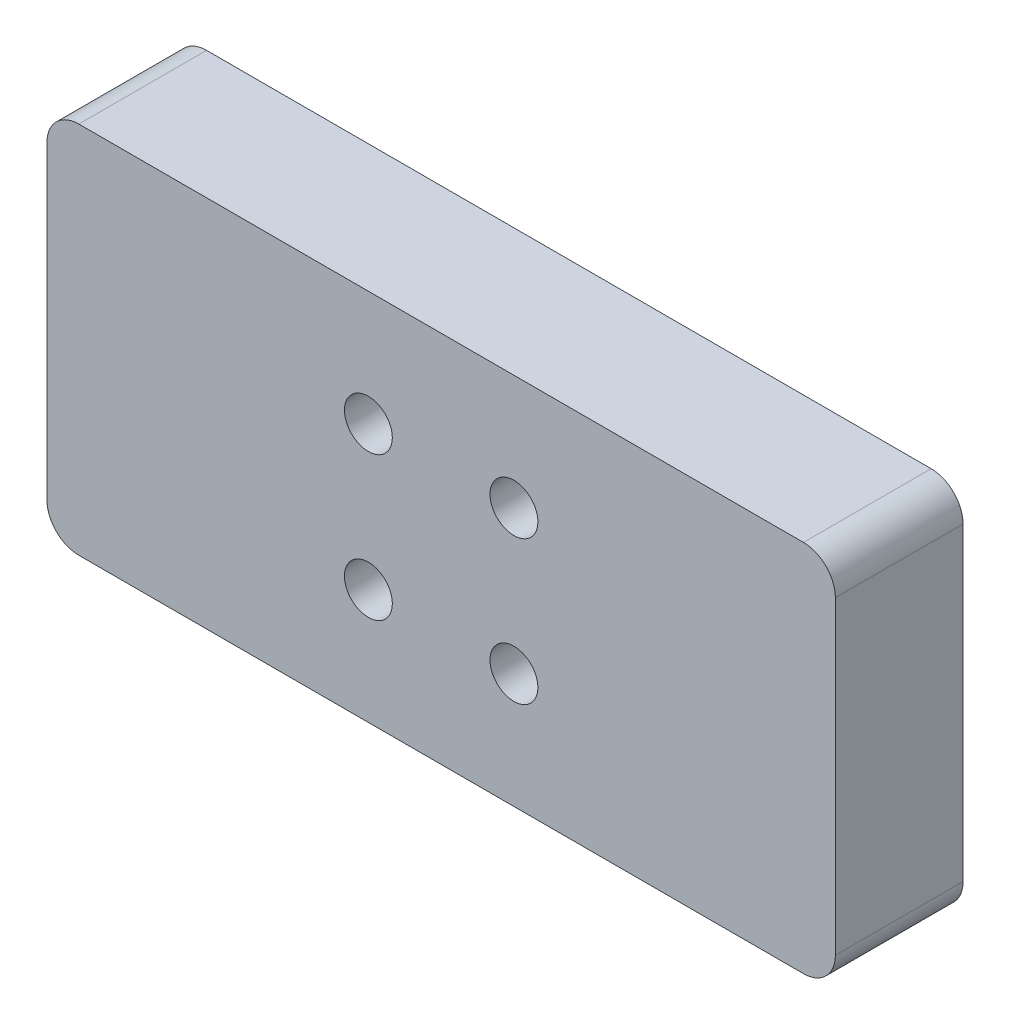
ISO-10303-21;
HEADER;
FILE_DESCRIPTION(('STEP AP214'),'2;1');
FILE_NAME('part.step','',(''),(''),'','','');
FILE_SCHEMA(('AUTOMOTIVE_DESIGN { 1 0 10303 214 1 1 1 1 }'));
ENDSEC;
DATA;
#1=APPLICATION_CONTEXT('core data for automotive mechanical design processes');
#2=APPLICATION_PROTOCOL_DEFINITION('international standard','automotive_design',2000,#1);
#3=PRODUCT_CONTEXT('',#1,'mechanical');
#4=PRODUCT('Part','Part','',(#3));
#5=PRODUCT_RELATED_PRODUCT_CATEGORY('part','',(#4));
#6=PRODUCT_DEFINITION_FORMATION('','',#4);
#7=PRODUCT_DEFINITION_CONTEXT('part definition',#1,'design');
#8=PRODUCT_DEFINITION('design','',#6,#7);
#9=PRODUCT_DEFINITION_SHAPE('','',#8);
#10=(LENGTH_UNIT() NAMED_UNIT(*) SI_UNIT(.MILLI.,.METRE.));
#11=(NAMED_UNIT(*) PLANE_ANGLE_UNIT() SI_UNIT($,.RADIAN.));
#12=(NAMED_UNIT(*) SI_UNIT($,.STERADIAN.) SOLID_ANGLE_UNIT());
#13=UNCERTAINTY_MEASURE_WITH_UNIT(LENGTH_MEASURE(1.E-05),#10,'distance_accuracy_value','');
#14=(GEOMETRIC_REPRESENTATION_CONTEXT(3) GLOBAL_UNCERTAINTY_ASSIGNED_CONTEXT((#13)) GLOBAL_UNIT_ASSIGNED_CONTEXT((#10,
#11,#12)) REPRESENTATION_CONTEXT('',''));
#15=CARTESIAN_POINT('',(0.,0.,0.));
#16=DIRECTION('',(0.,0.,1.));
#17=DIRECTION('',(1.,0.,0.));
#18=AXIS2_PLACEMENT_3D('',#15,#16,#17);
#19=CARTESIAN_POINT('',(31.369,-14.859,5.08));
#20=DIRECTION('',(-1.,0.,0.));
#21=DIRECTION('',(0.,0.,1.));
#22=AXIS2_PLACEMENT_3D('',#19,#20,#21);
#23=PLANE('',#22);
#24=DIRECTION('',(0.,1.,0.));
#25=VECTOR('',#24,1.);
#26=CARTESIAN_POINT('',(31.369,-14.859,-5.08));
#27=LINE('',#26,#25);
#28=CARTESIAN_POINT('',(31.369,-12.319,-5.08));
#29=VERTEX_POINT('',#28);
#30=CARTESIAN_POINT('',(31.369,12.319,-5.08));
#31=VERTEX_POINT('',#30);
#32=EDGE_CURVE('E144',#29,#31,#27,.T.);
#33=ORIENTED_EDGE('',*,*,#32,.T.);
#34=DIRECTION('',(0.,0.,-1.));
#35=VECTOR('',#34,1.);
#36=CARTESIAN_POINT('',(31.369,12.319,5.08));
#37=LINE('',#36,#35);
#38=CARTESIAN_POINT('',(31.369,12.319,5.08));
#39=VERTEX_POINT('',#38);
#40=EDGE_CURVE('E119',#31,#39,#37,.F.);
#41=ORIENTED_EDGE('',*,*,#40,.T.);
#42=DIRECTION('',(0.,1.,0.));
#43=VECTOR('',#42,1.);
#44=CARTESIAN_POINT('',(31.369,-14.859,5.08));
#45=LINE('',#44,#43);
#46=CARTESIAN_POINT('',(31.369,-12.319,5.08));
#47=VERTEX_POINT('',#46);
#48=EDGE_CURVE('E157',#47,#39,#45,.T.);
#49=ORIENTED_EDGE('',*,*,#48,.F.);
#50=DIRECTION('',(0.,0.,-1.));
#51=VECTOR('',#50,1.);
#52=CARTESIAN_POINT('',(31.369,-12.319,5.08));
#53=LINE('',#52,#51);
#54=EDGE_CURVE('E125',#47,#29,#53,.T.);
#55=ORIENTED_EDGE('',*,*,#54,.T.);
#56=EDGE_LOOP('',(#33,#41,#49,#55));
#57=FACE_BOUND('',#56,.T.);
#58=ADVANCED_FACE('F45',(#57),#23,.F.);
#59=CARTESIAN_POINT('',(-31.369,14.859,5.08));
#60=DIRECTION('',(0.,-1.,0.));
#61=DIRECTION('',(0.,0.,-1.));
#62=AXIS2_PLACEMENT_3D('',#59,#60,#61);
#63=PLANE('',#62);
#64=DIRECTION('',(-1.,0.,0.));
#65=VECTOR('',#64,1.);
#66=CARTESIAN_POINT('',(-31.369,14.859,5.08));
#67=LINE('',#66,#65);
#68=CARTESIAN_POINT('',(28.829,14.859,5.08));
#69=VERTEX_POINT('',#68);
#70=CARTESIAN_POINT('',(-28.829,14.859,5.08));
#71=VERTEX_POINT('',#70);
#72=EDGE_CURVE('E135',#69,#71,#67,.T.);
#73=ORIENTED_EDGE('',*,*,#72,.F.);
#74=DIRECTION('',(0.,0.,-1.));
#75=VECTOR('',#74,1.);
#76=CARTESIAN_POINT('',(28.829,14.859,5.08));
#77=LINE('',#76,#75);
#78=CARTESIAN_POINT('',(28.829,14.859,-5.08));
#79=VERTEX_POINT('',#78);
#80=EDGE_CURVE('E118',#69,#79,#77,.T.);
#81=ORIENTED_EDGE('',*,*,#80,.T.);
#82=DIRECTION('',(-1.,0.,0.));
#83=VECTOR('',#82,1.);
#84=CARTESIAN_POINT('',(-31.369,14.859,-5.08));
#85=LINE('',#84,#83);
#86=CARTESIAN_POINT('',(-28.829,14.859,-5.08));
#87=VERTEX_POINT('',#86);
#88=EDGE_CURVE('E132',#79,#87,#85,.T.);
#89=ORIENTED_EDGE('',*,*,#88,.T.);
#90=DIRECTION('',(0.,0.,-1.));
#91=VECTOR('',#90,1.);
#92=CARTESIAN_POINT('',(-28.829,14.859,5.08));
#93=LINE('',#92,#91);
#94=EDGE_CURVE('E138',#87,#71,#93,.F.);
#95=ORIENTED_EDGE('',*,*,#94,.T.);
#96=EDGE_LOOP('',(#73,#81,#89,#95));
#97=FACE_BOUND('',#96,.T.);
#98=ADVANCED_FACE('F131',(#97),#63,.F.);
#99=CARTESIAN_POINT('',(-31.369,-14.859,5.08));
#100=DIRECTION('',(1.,0.,0.));
#101=DIRECTION('',(0.,0.,-1.));
#102=AXIS2_PLACEMENT_3D('',#99,#100,#101);
#103=PLANE('',#102);
#104=DIRECTION('',(0.,-1.,0.));
#105=VECTOR('',#104,1.);
#106=CARTESIAN_POINT('',(-31.369,-14.859,-5.08));
#107=LINE('',#106,#105);
#108=CARTESIAN_POINT('',(-31.369,12.319,-5.08));
#109=VERTEX_POINT('',#108);
#110=CARTESIAN_POINT('',(-31.369,-12.319,-5.08));
#111=VERTEX_POINT('',#110);
#112=EDGE_CURVE('E143',#109,#111,#107,.T.);
#113=ORIENTED_EDGE('',*,*,#112,.T.);
#114=DIRECTION('',(0.,0.,-1.));
#115=VECTOR('',#114,1.);
#116=CARTESIAN_POINT('',(-31.369,-12.319,5.08));
#117=LINE('',#116,#115);
#118=CARTESIAN_POINT('',(-31.369,-12.319,5.08));
#119=VERTEX_POINT('',#118);
#120=EDGE_CURVE('E11',#111,#119,#117,.F.);
#121=ORIENTED_EDGE('',*,*,#120,.T.);
#122=DIRECTION('',(0.,-1.,0.));
#123=VECTOR('',#122,1.);
#124=CARTESIAN_POINT('',(-31.369,-14.859,5.08));
#125=LINE('',#124,#123);
#126=CARTESIAN_POINT('',(-31.369,12.319,5.08));
#127=VERTEX_POINT('',#126);
#128=EDGE_CURVE('E247',#127,#119,#125,.T.);
#129=ORIENTED_EDGE('',*,*,#128,.F.);
#130=DIRECTION('',(0.,0.,-1.));
#131=VECTOR('',#130,1.);
#132=CARTESIAN_POINT('',(-31.369,12.319,5.08));
#133=LINE('',#132,#131);
#134=EDGE_CURVE('E55',#127,#109,#133,.T.);
#135=ORIENTED_EDGE('',*,*,#134,.T.);
#136=EDGE_LOOP('',(#113,#121,#129,#135));
#137=FACE_BOUND('',#136,.T.);
#138=ADVANCED_FACE('F264',(#137),#103,.F.);
#139=CARTESIAN_POINT('',(-31.369,-14.859,5.08));
#140=DIRECTION('',(0.,1.,0.));
#141=DIRECTION('',(0.,0.,1.));
#142=AXIS2_PLACEMENT_3D('',#139,#140,#141);
#143=PLANE('',#142);
#144=DIRECTION('',(1.,0.,0.));
#145=VECTOR('',#144,1.);
#146=CARTESIAN_POINT('',(-31.369,-14.859,-5.08));
#147=LINE('',#146,#145);
#148=CARTESIAN_POINT('',(-28.829,-14.859,-5.08));
#149=VERTEX_POINT('',#148);
#150=CARTESIAN_POINT('',(28.829,-14.859,-5.08));
#151=VERTEX_POINT('',#150);
#152=EDGE_CURVE('E149',#149,#151,#147,.T.);
#153=ORIENTED_EDGE('',*,*,#152,.T.);
#154=DIRECTION('',(0.,0.,-1.));
#155=VECTOR('',#154,1.);
#156=CARTESIAN_POINT('',(28.829,-14.859,5.08));
#157=LINE('',#156,#155);
#158=CARTESIAN_POINT('',(28.829,-14.859,5.08));
#159=VERTEX_POINT('',#158);
#160=EDGE_CURVE('E63',#151,#159,#157,.F.);
#161=ORIENTED_EDGE('',*,*,#160,.T.);
#162=DIRECTION('',(1.,0.,0.));
#163=VECTOR('',#162,1.);
#164=CARTESIAN_POINT('',(-31.369,-14.859,5.08));
#165=LINE('',#164,#163);
#166=CARTESIAN_POINT('',(-28.829,-14.859,5.08));
#167=VERTEX_POINT('',#166);
#168=EDGE_CURVE('E159',#167,#159,#165,.T.);
#169=ORIENTED_EDGE('',*,*,#168,.F.);
#170=DIRECTION('',(0.,0.,-1.));
#171=VECTOR('',#170,1.);
#172=CARTESIAN_POINT('',(-28.829,-14.859,5.08));
#173=LINE('',#172,#171);
#174=EDGE_CURVE('E184',#167,#149,#173,.T.);
#175=ORIENTED_EDGE('',*,*,#174,.T.);
#176=EDGE_LOOP('',(#153,#161,#169,#175));
#177=FACE_BOUND('',#176,.T.);
#178=ADVANCED_FACE('F259',(#177),#143,.F.);
#179=CARTESIAN_POINT('',(0.,0.,5.08));
#180=DIRECTION('',(0.,0.,-1.));
#181=DIRECTION('',(-1.,0.,0.));
#182=AXIS2_PLACEMENT_3D('',#179,#180,#181);
#183=PLANE('',#182);
#184=CARTESIAN_POINT('',(-5.7912,-5.715,5.08));
#185=DIRECTION('',(0.,0.,-1.));
#186=DIRECTION('',(-1.,0.,0.));
#187=AXIS2_PLACEMENT_3D('',#184,#185,#186);
#188=CIRCLE('',#187,1.905);
#189=CARTESIAN_POINT('',(-7.6962,-5.715,5.08));
#190=VERTEX_POINT('',#189);
#191=EDGE_CURVE('E151',#190,#190,#188,.T.);
#192=ORIENTED_EDGE('',*,*,#191,.T.);
#193=EDGE_LOOP('',(#192));
#194=FACE_BOUND('',#193,.T.);
#195=CARTESIAN_POINT('',(5.7912,-5.715,5.08));
#196=DIRECTION('',(0.,0.,-1.));
#197=DIRECTION('',(-1.,0.,0.));
#198=AXIS2_PLACEMENT_3D('',#195,#196,#197);
#199=CIRCLE('',#198,1.905);
#200=CARTESIAN_POINT('',(3.8862,-5.715,5.08));
#201=VERTEX_POINT('',#200);
#202=EDGE_CURVE('E202',#201,#201,#199,.T.);
#203=ORIENTED_EDGE('',*,*,#202,.T.);
#204=EDGE_LOOP('',(#203));
#205=FACE_BOUND('',#204,.T.);
#206=CARTESIAN_POINT('',(5.7912,5.715,5.08));
#207=DIRECTION('',(0.,0.,-1.));
#208=DIRECTION('',(-1.,0.,0.));
#209=AXIS2_PLACEMENT_3D('',#206,#207,#208);
#210=CIRCLE('',#209,1.905);
#211=CARTESIAN_POINT('',(3.8862,5.715,5.08));
#212=VERTEX_POINT('',#211);
#213=EDGE_CURVE('E197',#212,#212,#210,.T.);
#214=ORIENTED_EDGE('',*,*,#213,.T.);
#215=EDGE_LOOP('',(#214));
#216=FACE_BOUND('',#215,.T.);
#217=CARTESIAN_POINT('',(-5.7912,5.715,5.08));
#218=DIRECTION('',(0.,0.,-1.));
#219=DIRECTION('',(-1.,0.,0.));
#220=AXIS2_PLACEMENT_3D('',#217,#218,#219);
#221=CIRCLE('',#220,1.905);
#222=CARTESIAN_POINT('',(-7.6962,5.715,5.08));
#223=VERTEX_POINT('',#222);
#224=EDGE_CURVE('E193',#223,#223,#221,.T.);
#225=ORIENTED_EDGE('',*,*,#224,.T.);
#226=EDGE_LOOP('',(#225));
#227=FACE_BOUND('',#226,.T.);
#228=ORIENTED_EDGE('',*,*,#48,.T.);
#229=CARTESIAN_POINT('',(28.829,12.319,5.08));
#230=DIRECTION('',(0.,0.,-1.));
#231=DIRECTION('',(-1.,0.,0.));
#232=AXIS2_PLACEMENT_3D('',#229,#230,#231);
#233=CIRCLE('',#232,2.54);
#234=EDGE_CURVE('E181',#39,#69,#233,.F.);
#235=ORIENTED_EDGE('',*,*,#234,.T.);
#236=ORIENTED_EDGE('',*,*,#72,.T.);
#237=CARTESIAN_POINT('',(-28.829,12.319,5.08));
#238=DIRECTION('',(0.,0.,-1.));
#239=DIRECTION('',(-1.,0.,0.));
#240=AXIS2_PLACEMENT_3D('',#237,#238,#239);
#241=CIRCLE('',#240,2.54);
#242=EDGE_CURVE('E173',#71,#127,#241,.F.);
#243=ORIENTED_EDGE('',*,*,#242,.T.);
#244=ORIENTED_EDGE('',*,*,#128,.T.);
#245=CARTESIAN_POINT('',(-28.829,-12.319,5.08));
#246=DIRECTION('',(0.,0.,-1.));
#247=DIRECTION('',(-1.,0.,0.));
#248=AXIS2_PLACEMENT_3D('',#245,#246,#247);
#249=CIRCLE('',#248,2.54);
#250=EDGE_CURVE('E70',#119,#167,#249,.F.);
#251=ORIENTED_EDGE('',*,*,#250,.T.);
#252=ORIENTED_EDGE('',*,*,#168,.T.);
#253=CARTESIAN_POINT('',(28.829,-12.319,5.08));
#254=DIRECTION('',(0.,0.,-1.));
#255=DIRECTION('',(-1.,0.,0.));
#256=AXIS2_PLACEMENT_3D('',#253,#254,#255);
#257=CIRCLE('',#256,2.54);
#258=EDGE_CURVE('E178',#159,#47,#257,.F.);
#259=ORIENTED_EDGE('',*,*,#258,.T.);
#260=EDGE_LOOP('',(#228,#235,#236,#243,#244,#251,#252,#259));
#261=FACE_BOUND('',#260,.T.);
#262=ADVANCED_FACE('F251',(#194,#205,#216,#227,#261),#183,.F.);
#263=CARTESIAN_POINT('',(0.,0.,-5.08));
#264=DIRECTION('',(0.,0.,-1.));
#265=DIRECTION('',(-1.,0.,0.));
#266=AXIS2_PLACEMENT_3D('',#263,#264,#265);
#267=PLANE('',#266);
#268=CARTESIAN_POINT('',(-25.4,7.9375,-5.08));
#269=DIRECTION('',(0.,0.,-1.));
#270=DIRECTION('',(-1.,0.,0.));
#271=AXIS2_PLACEMENT_3D('',#268,#269,#270);
#272=CIRCLE('',#271,1.905);
#273=CARTESIAN_POINT('',(-27.305,7.9375,-5.08));
#274=VERTEX_POINT('',#273);
#275=EDGE_CURVE('E49',#274,#274,#272,.T.);
#276=ORIENTED_EDGE('',*,*,#275,.F.);
#277=EDGE_LOOP('',(#276));
#278=FACE_BOUND('',#277,.T.);
#279=CARTESIAN_POINT('',(-25.4,-7.9375,-5.08));
#280=DIRECTION('',(0.,0.,-1.));
#281=DIRECTION('',(-1.,0.,0.));
#282=AXIS2_PLACEMENT_3D('',#279,#280,#281);
#283=CIRCLE('',#282,1.905);
#284=CARTESIAN_POINT('',(-27.305,-7.9375,-5.08));
#285=VERTEX_POINT('',#284);
#286=EDGE_CURVE('E217',#285,#285,#283,.T.);
#287=ORIENTED_EDGE('',*,*,#286,.F.);
#288=EDGE_LOOP('',(#287));
#289=FACE_BOUND('',#288,.T.);
#290=CARTESIAN_POINT('',(25.4,-7.9375,-5.08));
#291=DIRECTION('',(0.,0.,-1.));
#292=DIRECTION('',(-1.,0.,0.));
#293=AXIS2_PLACEMENT_3D('',#290,#291,#292);
#294=CIRCLE('',#293,1.905);
#295=CARTESIAN_POINT('',(23.495,-7.9375,-5.08));
#296=VERTEX_POINT('',#295);
#297=EDGE_CURVE('E213',#296,#296,#294,.T.);
#298=ORIENTED_EDGE('',*,*,#297,.F.);
#299=EDGE_LOOP('',(#298));
#300=FACE_BOUND('',#299,.T.);
#301=CARTESIAN_POINT('',(25.4,7.9375,-5.08));
#302=DIRECTION('',(0.,0.,-1.));
#303=DIRECTION('',(-1.,0.,0.));
#304=AXIS2_PLACEMENT_3D('',#301,#302,#303);
#305=CIRCLE('',#304,1.905);
#306=CARTESIAN_POINT('',(23.495,7.9375,-5.08));
#307=VERTEX_POINT('',#306);
#308=EDGE_CURVE('E209',#307,#307,#305,.T.);
#309=ORIENTED_EDGE('',*,*,#308,.F.);
#310=EDGE_LOOP('',(#309));
#311=FACE_BOUND('',#310,.T.);
#312=ORIENTED_EDGE('',*,*,#88,.F.);
#313=CARTESIAN_POINT('',(28.829,12.319,-5.08));
#314=DIRECTION('',(0.,0.,-1.));
#315=DIRECTION('',(-1.,0.,0.));
#316=AXIS2_PLACEMENT_3D('',#313,#314,#315);
#317=CIRCLE('',#316,2.54);
#318=EDGE_CURVE('E114',#79,#31,#317,.T.);
#319=ORIENTED_EDGE('',*,*,#318,.T.);
#320=ORIENTED_EDGE('',*,*,#32,.F.);
#321=CARTESIAN_POINT('',(28.829,-12.319,-5.08));
#322=DIRECTION('',(0.,0.,-1.));
#323=DIRECTION('',(-1.,0.,0.));
#324=AXIS2_PLACEMENT_3D('',#321,#322,#323);
#325=CIRCLE('',#324,2.54);
#326=EDGE_CURVE('E126',#29,#151,#325,.T.);
#327=ORIENTED_EDGE('',*,*,#326,.T.);
#328=ORIENTED_EDGE('',*,*,#152,.F.);
#329=CARTESIAN_POINT('',(-28.829,-12.319,-5.08));
#330=DIRECTION('',(0.,0.,-1.));
#331=DIRECTION('',(-1.,0.,0.));
#332=AXIS2_PLACEMENT_3D('',#329,#330,#331);
#333=CIRCLE('',#332,2.54);
#334=EDGE_CURVE('E163',#149,#111,#333,.T.);
#335=ORIENTED_EDGE('',*,*,#334,.T.);
#336=ORIENTED_EDGE('',*,*,#112,.F.);
#337=CARTESIAN_POINT('',(-28.829,12.319,-5.08));
#338=DIRECTION('',(0.,0.,-1.));
#339=DIRECTION('',(-1.,0.,0.));
#340=AXIS2_PLACEMENT_3D('',#337,#338,#339);
#341=CIRCLE('',#340,2.54);
#342=EDGE_CURVE('E137',#109,#87,#341,.T.);
#343=ORIENTED_EDGE('',*,*,#342,.T.);
#344=EDGE_LOOP('',(#312,#319,#320,#327,#328,#335,#336,#343));
#345=FACE_BOUND('',#344,.T.);
#346=ADVANCED_FACE('F140',(#278,#289,#300,#311,#345),#267,.T.);
#347=CARTESIAN_POINT('',(28.829,12.319,5.08));
#348=DIRECTION('',(0.,0.,-1.));
#349=DIRECTION('',(-1.,0.,0.));
#350=AXIS2_PLACEMENT_3D('',#347,#348,#349);
#351=CYLINDRICAL_SURFACE('',#350,2.54);
#352=ORIENTED_EDGE('',*,*,#234,.F.);
#353=ORIENTED_EDGE('',*,*,#40,.F.);
#354=ORIENTED_EDGE('',*,*,#318,.F.);
#355=ORIENTED_EDGE('',*,*,#80,.F.);
#356=EDGE_LOOP('',(#352,#353,#354,#355));
#357=FACE_BOUND('',#356,.T.);
#358=ADVANCED_FACE('F117',(#357),#351,.T.);
#359=CARTESIAN_POINT('',(28.829,-12.319,5.08));
#360=DIRECTION('',(0.,0.,-1.));
#361=DIRECTION('',(-1.,0.,0.));
#362=AXIS2_PLACEMENT_3D('',#359,#360,#361);
#363=CYLINDRICAL_SURFACE('',#362,2.54);
#364=ORIENTED_EDGE('',*,*,#258,.F.);
#365=ORIENTED_EDGE('',*,*,#160,.F.);
#366=ORIENTED_EDGE('',*,*,#326,.F.);
#367=ORIENTED_EDGE('',*,*,#54,.F.);
#368=EDGE_LOOP('',(#364,#365,#366,#367));
#369=FACE_BOUND('',#368,.T.);
#370=ADVANCED_FACE('F256',(#369),#363,.T.);
#371=CARTESIAN_POINT('',(-28.829,-12.319,5.08));
#372=DIRECTION('',(0.,0.,-1.));
#373=DIRECTION('',(-1.,0.,0.));
#374=AXIS2_PLACEMENT_3D('',#371,#372,#373);
#375=CYLINDRICAL_SURFACE('',#374,2.54);
#376=ORIENTED_EDGE('',*,*,#250,.F.);
#377=ORIENTED_EDGE('',*,*,#120,.F.);
#378=ORIENTED_EDGE('',*,*,#334,.F.);
#379=ORIENTED_EDGE('',*,*,#174,.F.);
#380=EDGE_LOOP('',(#376,#377,#378,#379));
#381=FACE_BOUND('',#380,.T.);
#382=ADVANCED_FACE('F261',(#381),#375,.T.);
#383=CARTESIAN_POINT('',(-28.829,12.319,5.08));
#384=DIRECTION('',(0.,0.,-1.));
#385=DIRECTION('',(-1.,0.,0.));
#386=AXIS2_PLACEMENT_3D('',#383,#384,#385);
#387=CYLINDRICAL_SURFACE('',#386,2.54);
#388=ORIENTED_EDGE('',*,*,#242,.F.);
#389=ORIENTED_EDGE('',*,*,#94,.F.);
#390=ORIENTED_EDGE('',*,*,#342,.F.);
#391=ORIENTED_EDGE('',*,*,#134,.F.);
#392=EDGE_LOOP('',(#388,#389,#390,#391));
#393=FACE_BOUND('',#392,.T.);
#394=ADVANCED_FACE('F47',(#393),#387,.T.);
#395=CARTESIAN_POINT('',(-5.7912,5.715,0.0799999999999985));
#396=DIRECTION('',(0.,0.,1.));
#397=DIRECTION('',(1.,0.,0.));
#398=AXIS2_PLACEMENT_3D('',#395,#396,#397);
#399=CYLINDRICAL_SURFACE('',#398,1.905);
#400=CARTESIAN_POINT('',(-5.7912,5.715,0.0799999999999985));
#401=DIRECTION('',(0.,0.,1.));
#402=DIRECTION('',(1.,0.,0.));
#403=AXIS2_PLACEMENT_3D('',#400,#401,#402);
#404=CIRCLE('',#403,1.905);
#405=CARTESIAN_POINT('',(-3.8862,5.715,0.0799999999999985));
#406=VERTEX_POINT('',#405);
#407=EDGE_CURVE('E198',#406,#406,#404,.T.);
#408=ORIENTED_EDGE('',*,*,#407,.F.);
#409=EDGE_LOOP('',(#408));
#410=FACE_BOUND('',#409,.T.);
#411=ORIENTED_EDGE('',*,*,#224,.F.);
#412=EDGE_LOOP('',(#411));
#413=FACE_BOUND('',#412,.T.);
#414=ADVANCED_FACE('F270',(#410,#413),#399,.F.);
#415=CARTESIAN_POINT('',(-5.7912,5.715,0.0799999999999985));
#416=DIRECTION('',(0.,0.,1.));
#417=DIRECTION('',(1.,0.,0.));
#418=AXIS2_PLACEMENT_3D('',#415,#416,#417);
#419=PLANE('',#418);
#420=ORIENTED_EDGE('',*,*,#407,.T.);
#421=EDGE_LOOP('',(#420));
#422=FACE_BOUND('',#421,.T.);
#423=ADVANCED_FACE('F276',(#422),#419,.T.);
#424=CARTESIAN_POINT('',(5.7912,5.715,0.0799999999999985));
#425=DIRECTION('',(0.,0.,1.));
#426=DIRECTION('',(1.,0.,0.));
#427=AXIS2_PLACEMENT_3D('',#424,#425,#426);
#428=CYLINDRICAL_SURFACE('',#427,1.905);
#429=CARTESIAN_POINT('',(5.7912,5.715,0.0799999999999985));
#430=DIRECTION('',(0.,0.,1.));
#431=DIRECTION('',(1.,0.,0.));
#432=AXIS2_PLACEMENT_3D('',#429,#430,#431);
#433=CIRCLE('',#432,1.905);
#434=CARTESIAN_POINT('',(7.6962,5.715,0.0799999999999985));
#435=VERTEX_POINT('',#434);
#436=EDGE_CURVE('E235',#435,#435,#433,.T.);
#437=ORIENTED_EDGE('',*,*,#436,.F.);
#438=EDGE_LOOP('',(#437));
#439=FACE_BOUND('',#438,.T.);
#440=ORIENTED_EDGE('',*,*,#213,.F.);
#441=EDGE_LOOP('',(#440));
#442=FACE_BOUND('',#441,.T.);
#443=ADVANCED_FACE('F320',(#439,#442),#428,.F.);
#444=CARTESIAN_POINT('',(5.7912,5.715,0.0799999999999985));
#445=DIRECTION('',(0.,0.,1.));
#446=DIRECTION('',(1.,0.,0.));
#447=AXIS2_PLACEMENT_3D('',#444,#445,#446);
#448=PLANE('',#447);
#449=ORIENTED_EDGE('',*,*,#436,.T.);
#450=EDGE_LOOP('',(#449));
#451=FACE_BOUND('',#450,.T.);
#452=ADVANCED_FACE('F330',(#451),#448,.T.);
#453=CARTESIAN_POINT('',(5.7912,-5.715,0.0799999999999985));
#454=DIRECTION('',(0.,0.,1.));
#455=DIRECTION('',(1.,0.,0.));
#456=AXIS2_PLACEMENT_3D('',#453,#454,#455);
#457=CYLINDRICAL_SURFACE('',#456,1.905);
#458=CARTESIAN_POINT('',(5.7912,-5.715,0.0799999999999985));
#459=DIRECTION('',(0.,0.,1.));
#460=DIRECTION('',(1.,0.,0.));
#461=AXIS2_PLACEMENT_3D('',#458,#459,#460);
#462=CIRCLE('',#461,1.905);
#463=CARTESIAN_POINT('',(7.6962,-5.715,0.0799999999999985));
#464=VERTEX_POINT('',#463);
#465=EDGE_CURVE('E229',#464,#464,#462,.T.);
#466=ORIENTED_EDGE('',*,*,#465,.F.);
#467=EDGE_LOOP('',(#466));
#468=FACE_BOUND('',#467,.T.);
#469=ORIENTED_EDGE('',*,*,#202,.F.);
#470=EDGE_LOOP('',(#469));
#471=FACE_BOUND('',#470,.T.);
#472=ADVANCED_FACE('F340',(#468,#471),#457,.F.);
#473=CARTESIAN_POINT('',(5.7912,-5.715,0.0799999999999985));
#474=DIRECTION('',(0.,0.,1.));
#475=DIRECTION('',(1.,0.,0.));
#476=AXIS2_PLACEMENT_3D('',#473,#474,#475);
#477=PLANE('',#476);
#478=ORIENTED_EDGE('',*,*,#465,.T.);
#479=EDGE_LOOP('',(#478));
#480=FACE_BOUND('',#479,.T.);
#481=ADVANCED_FACE('F350',(#480),#477,.T.);
#482=CARTESIAN_POINT('',(-5.7912,-5.715,0.0799999999999985));
#483=DIRECTION('',(0.,0.,1.));
#484=DIRECTION('',(1.,0.,0.));
#485=AXIS2_PLACEMENT_3D('',#482,#483,#484);
#486=CYLINDRICAL_SURFACE('',#485,1.905);
#487=CARTESIAN_POINT('',(-5.7912,-5.715,0.0799999999999985));
#488=DIRECTION('',(0.,0.,1.));
#489=DIRECTION('',(1.,0.,0.));
#490=AXIS2_PLACEMENT_3D('',#487,#488,#489);
#491=CIRCLE('',#490,1.905);
#492=CARTESIAN_POINT('',(-3.8862,-5.715,0.0799999999999985));
#493=VERTEX_POINT('',#492);
#494=EDGE_CURVE('E224',#493,#493,#491,.T.);
#495=ORIENTED_EDGE('',*,*,#494,.F.);
#496=EDGE_LOOP('',(#495));
#497=FACE_BOUND('',#496,.T.);
#498=ORIENTED_EDGE('',*,*,#191,.F.);
#499=EDGE_LOOP('',(#498));
#500=FACE_BOUND('',#499,.T.);
#501=ADVANCED_FACE('F360',(#497,#500),#486,.F.);
#502=CARTESIAN_POINT('',(-5.7912,-5.715,0.0799999999999985));
#503=DIRECTION('',(0.,0.,1.));
#504=DIRECTION('',(1.,0.,0.));
#505=AXIS2_PLACEMENT_3D('',#502,#503,#504);
#506=PLANE('',#505);
#507=ORIENTED_EDGE('',*,*,#494,.T.);
#508=EDGE_LOOP('',(#507));
#509=FACE_BOUND('',#508,.T.);
#510=ADVANCED_FACE('F370',(#509),#506,.T.);
#511=CARTESIAN_POINT('',(25.4,7.9375,-2.08));
#512=DIRECTION('',(0.,0.,-1.));
#513=DIRECTION('',(-1.,0.,0.));
#514=AXIS2_PLACEMENT_3D('',#511,#512,#513);
#515=CYLINDRICAL_SURFACE('',#514,1.905);
#516=ORIENTED_EDGE('',*,*,#308,.T.);
#517=EDGE_LOOP('',(#516));
#518=FACE_BOUND('',#517,.T.);
#519=CARTESIAN_POINT('',(25.4,7.9375,-2.08));
#520=DIRECTION('',(0.,0.,-1.));
#521=DIRECTION('',(-1.,0.,0.));
#522=AXIS2_PLACEMENT_3D('',#519,#520,#521);
#523=CIRCLE('',#522,1.905);
#524=CARTESIAN_POINT('',(23.495,7.9375,-2.08));
#525=VERTEX_POINT('',#524);
#526=EDGE_CURVE('E214',#525,#525,#523,.T.);
#527=ORIENTED_EDGE('',*,*,#526,.F.);
#528=EDGE_LOOP('',(#527));
#529=FACE_BOUND('',#528,.T.);
#530=ADVANCED_FACE('F380',(#518,#529),#515,.F.);
#531=CARTESIAN_POINT('',(25.4,7.9375,-2.08));
#532=DIRECTION('',(0.,0.,-1.));
#533=DIRECTION('',(-1.,0.,0.));
#534=AXIS2_PLACEMENT_3D('',#531,#532,#533);
#535=PLANE('',#534);
#536=ORIENTED_EDGE('',*,*,#526,.T.);
#537=EDGE_LOOP('',(#536));
#538=FACE_BOUND('',#537,.T.);
#539=ADVANCED_FACE('F390',(#538),#535,.T.);
#540=CARTESIAN_POINT('',(25.4,-7.9375,-2.08));
#541=DIRECTION('',(0.,0.,-1.));
#542=DIRECTION('',(-1.,0.,0.));
#543=AXIS2_PLACEMENT_3D('',#540,#541,#542);
#544=CYLINDRICAL_SURFACE('',#543,1.905);
#545=ORIENTED_EDGE('',*,*,#297,.T.);
#546=EDGE_LOOP('',(#545));
#547=FACE_BOUND('',#546,.T.);
#548=CARTESIAN_POINT('',(25.4,-7.9375,-2.08));
#549=DIRECTION('',(0.,0.,-1.));
#550=DIRECTION('',(-1.,0.,0.));
#551=AXIS2_PLACEMENT_3D('',#548,#549,#550);
#552=CIRCLE('',#551,1.905);
#553=CARTESIAN_POINT('',(23.495,-7.9375,-2.08));
#554=VERTEX_POINT('',#553);
#555=EDGE_CURVE('E516',#554,#554,#552,.T.);
#556=ORIENTED_EDGE('',*,*,#555,.F.);
#557=EDGE_LOOP('',(#556));
#558=FACE_BOUND('',#557,.T.);
#559=ADVANCED_FACE('F400',(#547,#558),#544,.F.);
#560=CARTESIAN_POINT('',(25.4,-7.9375,-2.08));
#561=DIRECTION('',(0.,0.,-1.));
#562=DIRECTION('',(-1.,0.,0.));
#563=AXIS2_PLACEMENT_3D('',#560,#561,#562);
#564=PLANE('',#563);
#565=ORIENTED_EDGE('',*,*,#555,.T.);
#566=EDGE_LOOP('',(#565));
#567=FACE_BOUND('',#566,.T.);
#568=ADVANCED_FACE('F410',(#567),#564,.T.);
#569=CARTESIAN_POINT('',(-25.4,-7.9375,-2.08));
#570=DIRECTION('',(0.,0.,-1.));
#571=DIRECTION('',(-1.,0.,0.));
#572=AXIS2_PLACEMENT_3D('',#569,#570,#571);
#573=CYLINDRICAL_SURFACE('',#572,1.905);
#574=ORIENTED_EDGE('',*,*,#286,.T.);
#575=EDGE_LOOP('',(#574));
#576=FACE_BOUND('',#575,.T.);
#577=CARTESIAN_POINT('',(-25.4,-7.9375,-2.08));
#578=DIRECTION('',(0.,0.,-1.));
#579=DIRECTION('',(-1.,0.,0.));
#580=AXIS2_PLACEMENT_3D('',#577,#578,#579);
#581=CIRCLE('',#580,1.905);
#582=CARTESIAN_POINT('',(-27.305,-7.9375,-2.08));
#583=VERTEX_POINT('',#582);
#584=EDGE_CURVE('E520',#583,#583,#581,.T.);
#585=ORIENTED_EDGE('',*,*,#584,.F.);
#586=EDGE_LOOP('',(#585));
#587=FACE_BOUND('',#586,.T.);
#588=ADVANCED_FACE('F420',(#576,#587),#573,.F.);
#589=CARTESIAN_POINT('',(-25.4,-7.9375,-2.08));
#590=DIRECTION('',(0.,0.,-1.));
#591=DIRECTION('',(-1.,0.,0.));
#592=AXIS2_PLACEMENT_3D('',#589,#590,#591);
#593=PLANE('',#592);
#594=ORIENTED_EDGE('',*,*,#584,.T.);
#595=EDGE_LOOP('',(#594));
#596=FACE_BOUND('',#595,.T.);
#597=ADVANCED_FACE('F430',(#596),#593,.T.);
#598=CARTESIAN_POINT('',(-25.4,7.9375,-2.08));
#599=DIRECTION('',(0.,0.,-1.));
#600=DIRECTION('',(-1.,0.,0.));
#601=AXIS2_PLACEMENT_3D('',#598,#599,#600);
#602=CYLINDRICAL_SURFACE('',#601,1.905);
#603=ORIENTED_EDGE('',*,*,#275,.T.);
#604=EDGE_LOOP('',(#603));
#605=FACE_BOUND('',#604,.T.);
#606=CARTESIAN_POINT('',(-25.4,7.9375,-2.08));
#607=DIRECTION('',(0.,0.,-1.));
#608=DIRECTION('',(-1.,0.,0.));
#609=AXIS2_PLACEMENT_3D('',#606,#607,#608);
#610=CIRCLE('',#609,1.905);
#611=CARTESIAN_POINT('',(-27.305,7.9375,-2.08));
#612=VERTEX_POINT('',#611);
#613=EDGE_CURVE('E523',#612,#612,#610,.T.);
#614=ORIENTED_EDGE('',*,*,#613,.F.);
#615=EDGE_LOOP('',(#614));
#616=FACE_BOUND('',#615,.T.);
#617=ADVANCED_FACE('F439',(#605,#616),#602,.F.);
#618=CARTESIAN_POINT('',(-25.4,7.9375,-2.08));
#619=DIRECTION('',(0.,0.,-1.));
#620=DIRECTION('',(-1.,0.,0.));
#621=AXIS2_PLACEMENT_3D('',#618,#619,#620);
#622=PLANE('',#621);
#623=ORIENTED_EDGE('',*,*,#613,.T.);
#624=EDGE_LOOP('',(#623));
#625=FACE_BOUND('',#624,.T.);
#626=ADVANCED_FACE('F449',(#625),#622,.T.);
#627=CLOSED_SHELL('',(#58,#98,#138,#178,#262,#346,#358,#370,#382,#394,#414,#423,#443,#452,#472,
#481,#501,#510,#530,#539,#559,#568,#588,#597,#617,#626));
#628=MANIFOLD_SOLID_BREP('B2',#627);
#629=ADVANCED_BREP_SHAPE_REPRESENTATION('',(#18,#628),#14);
#630=SHAPE_DEFINITION_REPRESENTATION(#9,#629);
ENDSEC;
END-ISO-10303-21;
